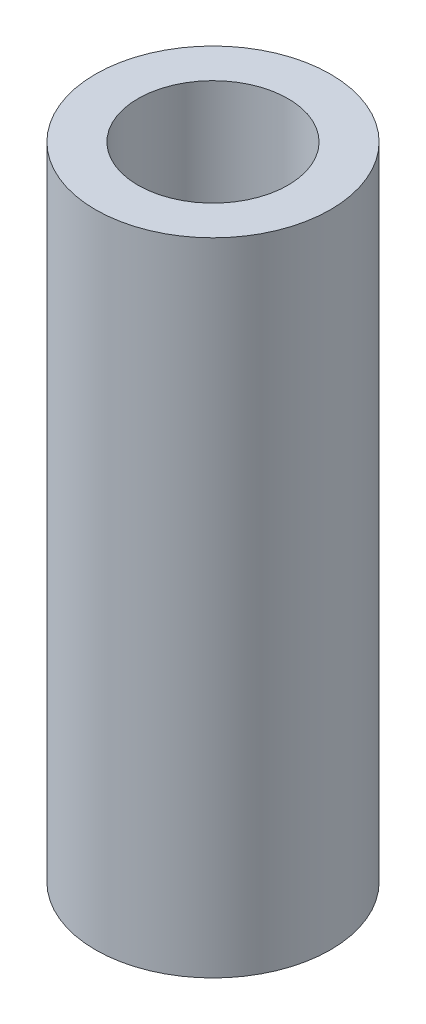
ISO-10303-21;
HEADER;
FILE_DESCRIPTION(('STEP AP214'),'2;1');
FILE_NAME('part.step','',(''),(''),'','','');
FILE_SCHEMA(('AUTOMOTIVE_DESIGN { 1 0 10303 214 1 1 1 1 }'));
ENDSEC;
DATA;
#1=APPLICATION_CONTEXT('core data for automotive mechanical design processes');
#2=APPLICATION_PROTOCOL_DEFINITION('international standard','automotive_design',2000,#1);
#3=PRODUCT_CONTEXT('',#1,'mechanical');
#4=PRODUCT('Part','Part','',(#3));
#5=PRODUCT_RELATED_PRODUCT_CATEGORY('part','',(#4));
#6=PRODUCT_DEFINITION_FORMATION('','',#4);
#7=PRODUCT_DEFINITION_CONTEXT('part definition',#1,'design');
#8=PRODUCT_DEFINITION('design','',#6,#7);
#9=PRODUCT_DEFINITION_SHAPE('','',#8);
#10=(LENGTH_UNIT() NAMED_UNIT(*) SI_UNIT(.MILLI.,.METRE.));
#11=(NAMED_UNIT(*) PLANE_ANGLE_UNIT() SI_UNIT($,.RADIAN.));
#12=(NAMED_UNIT(*) SI_UNIT($,.STERADIAN.) SOLID_ANGLE_UNIT());
#13=UNCERTAINTY_MEASURE_WITH_UNIT(LENGTH_MEASURE(1.E-05),#10,'distance_accuracy_value','');
#14=(GEOMETRIC_REPRESENTATION_CONTEXT(3) GLOBAL_UNCERTAINTY_ASSIGNED_CONTEXT((#13)) GLOBAL_UNIT_ASSIGNED_CONTEXT((#10,
#11,#12)) REPRESENTATION_CONTEXT('',''));
#15=CARTESIAN_POINT('',(0.,0.,0.));
#16=DIRECTION('',(0.,0.,1.));
#17=DIRECTION('',(1.,0.,0.));
#18=AXIS2_PLACEMENT_3D('',#15,#16,#17);
#19=CARTESIAN_POINT('',(0.,136.431675432501,0.));
#20=DIRECTION('',(0.,-1.,0.));
#21=DIRECTION('',(0.,0.,-1.));
#22=AXIS2_PLACEMENT_3D('',#19,#20,#21);
#23=CYLINDRICAL_SURFACE('',#22,25.);
#24=CARTESIAN_POINT('',(0.,136.431675432501,0.));
#25=DIRECTION('',(0.,1.,0.));
#26=DIRECTION('',(0.,0.,1.));
#27=AXIS2_PLACEMENT_3D('',#24,#25,#26);
#28=CIRCLE('',#27,25.);
#29=CARTESIAN_POINT('',(0.,136.431675432501,25.));
#30=VERTEX_POINT('',#29);
#31=EDGE_CURVE('E10',#30,#30,#28,.T.);
#32=ORIENTED_EDGE('',*,*,#31,.F.);
#33=EDGE_LOOP('',(#32));
#34=FACE_BOUND('',#33,.T.);
#35=CARTESIAN_POINT('',(0.,0.,0.));
#36=DIRECTION('',(0.,1.,0.));
#37=DIRECTION('',(0.,0.,1.));
#38=AXIS2_PLACEMENT_3D('',#35,#36,#37);
#39=CIRCLE('',#38,25.);
#40=CARTESIAN_POINT('',(0.,0.,25.));
#41=VERTEX_POINT('',#40);
#42=EDGE_CURVE('E37',#41,#41,#39,.T.);
#43=ORIENTED_EDGE('',*,*,#42,.T.);
#44=EDGE_LOOP('',(#43));
#45=FACE_BOUND('',#44,.T.);
#46=ADVANCED_FACE('F40',(#34,#45),#23,.T.);
#47=CARTESIAN_POINT('',(0.,136.431675432501,0.));
#48=DIRECTION('',(0.,1.,0.));
#49=DIRECTION('',(0.,0.,1.));
#50=AXIS2_PLACEMENT_3D('',#47,#48,#49);
#51=PLANE('',#50);
#52=CARTESIAN_POINT('',(0.,136.431675432501,0.));
#53=DIRECTION('',(0.,1.,0.));
#54=DIRECTION('',(0.,0.,1.));
#55=AXIS2_PLACEMENT_3D('',#52,#53,#54);
#56=CIRCLE('',#55,15.9710090968942);
#57=CARTESIAN_POINT('',(0.,136.431675432501,15.9710090968942));
#58=VERTEX_POINT('',#57);
#59=EDGE_CURVE('E50',#58,#58,#56,.T.);
#60=ORIENTED_EDGE('',*,*,#59,.F.);
#61=EDGE_LOOP('',(#60));
#62=FACE_BOUND('',#61,.T.);
#63=ORIENTED_EDGE('',*,*,#31,.T.);
#64=EDGE_LOOP('',(#63));
#65=FACE_BOUND('',#64,.T.);
#66=ADVANCED_FACE('F59',(#62,#65),#51,.T.);
#67=CARTESIAN_POINT('',(0.,0.,0.));
#68=DIRECTION('',(0.,1.,0.));
#69=DIRECTION('',(0.,0.,1.));
#70=AXIS2_PLACEMENT_3D('',#67,#68,#69);
#71=PLANE('',#70);
#72=CARTESIAN_POINT('',(0.,0.,0.));
#73=DIRECTION('',(0.,1.,0.));
#74=DIRECTION('',(0.,0.,1.));
#75=AXIS2_PLACEMENT_3D('',#72,#73,#74);
#76=CIRCLE('',#75,15.9710090968942);
#77=CARTESIAN_POINT('',(0.,0.,15.9710090968942));
#78=VERTEX_POINT('',#77);
#79=EDGE_CURVE('E47',#78,#78,#76,.T.);
#80=ORIENTED_EDGE('',*,*,#79,.T.);
#81=EDGE_LOOP('',(#80));
#82=FACE_BOUND('',#81,.T.);
#83=ORIENTED_EDGE('',*,*,#42,.F.);
#84=EDGE_LOOP('',(#83));
#85=FACE_BOUND('',#84,.T.);
#86=ADVANCED_FACE('F58',(#82,#85),#71,.F.);
#87=CARTESIAN_POINT('',(0.,136.431675432501,0.));
#88=DIRECTION('',(0.,-1.,0.));
#89=DIRECTION('',(0.,0.,-1.));
#90=AXIS2_PLACEMENT_3D('',#87,#88,#89);
#91=CYLINDRICAL_SURFACE('',#90,15.9710090968942);
#92=ORIENTED_EDGE('',*,*,#59,.T.);
#93=EDGE_LOOP('',(#92));
#94=FACE_BOUND('',#93,.T.);
#95=ORIENTED_EDGE('',*,*,#79,.F.);
#96=EDGE_LOOP('',(#95));
#97=FACE_BOUND('',#96,.T.);
#98=ADVANCED_FACE('F54',(#94,#97),#91,.F.);
#99=CLOSED_SHELL('',(#46,#66,#86,#98));
#100=MANIFOLD_SOLID_BREP('B2',#99);
#101=ADVANCED_BREP_SHAPE_REPRESENTATION('',(#18,#100),#14);
#102=SHAPE_DEFINITION_REPRESENTATION(#9,#101);
ENDSEC;
END-ISO-10303-21;
